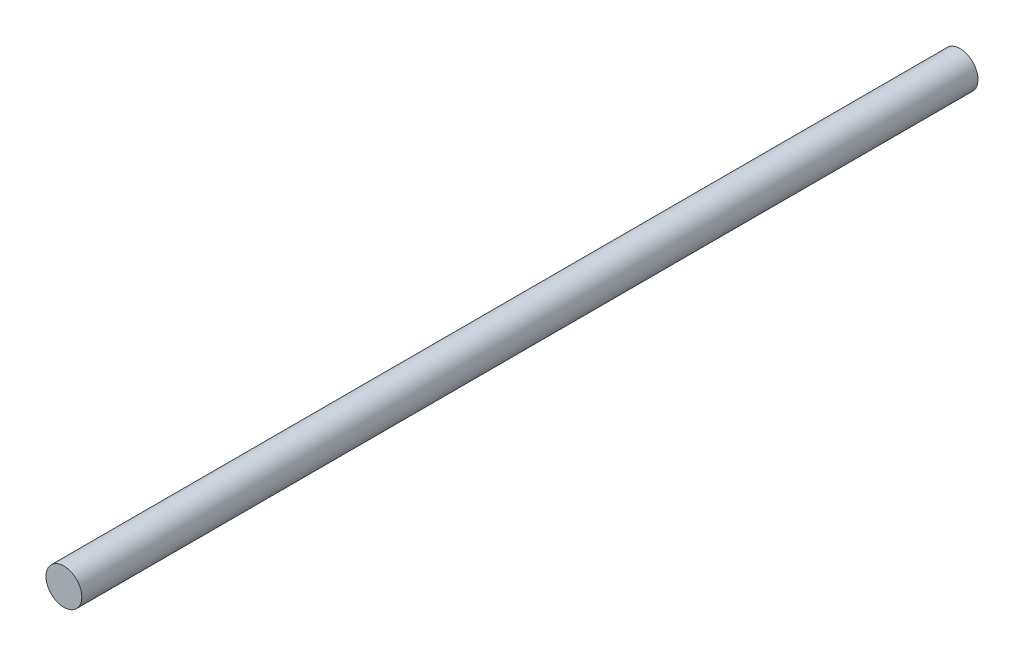
ISO-10303-21;
HEADER;
FILE_DESCRIPTION(('STEP AP214'),'2;1');
FILE_NAME('part.step','',(''),(''),'','','');
FILE_SCHEMA(('AUTOMOTIVE_DESIGN { 1 0 10303 214 1 1 1 1 }'));
ENDSEC;
DATA;
#1=APPLICATION_CONTEXT('core data for automotive mechanical design processes');
#2=APPLICATION_PROTOCOL_DEFINITION('international standard','automotive_design',2000,#1);
#3=PRODUCT_CONTEXT('',#1,'mechanical');
#4=PRODUCT('Part','Part','',(#3));
#5=PRODUCT_RELATED_PRODUCT_CATEGORY('part','',(#4));
#6=PRODUCT_DEFINITION_FORMATION('','',#4);
#7=PRODUCT_DEFINITION_CONTEXT('part definition',#1,'design');
#8=PRODUCT_DEFINITION('design','',#6,#7);
#9=PRODUCT_DEFINITION_SHAPE('','',#8);
#10=(LENGTH_UNIT() NAMED_UNIT(*) SI_UNIT(.MILLI.,.METRE.));
#11=(NAMED_UNIT(*) PLANE_ANGLE_UNIT() SI_UNIT($,.RADIAN.));
#12=(NAMED_UNIT(*) SI_UNIT($,.STERADIAN.) SOLID_ANGLE_UNIT());
#13=UNCERTAINTY_MEASURE_WITH_UNIT(LENGTH_MEASURE(1.E-05),#10,'distance_accuracy_value','');
#14=(GEOMETRIC_REPRESENTATION_CONTEXT(3) GLOBAL_UNCERTAINTY_ASSIGNED_CONTEXT((#13)) GLOBAL_UNIT_ASSIGNED_CONTEXT((#10,
#11,#12)) REPRESENTATION_CONTEXT('',''));
#15=CARTESIAN_POINT('',(0.,0.,0.));
#16=DIRECTION('',(0.,0.,1.));
#17=DIRECTION('',(1.,0.,0.));
#18=AXIS2_PLACEMENT_3D('',#15,#16,#17);
#19=CARTESIAN_POINT('',(0.,0.,150.));
#20=DIRECTION('',(0.,0.,-1.));
#21=DIRECTION('',(-1.,0.,0.));
#22=AXIS2_PLACEMENT_3D('',#19,#20,#21);
#23=CYLINDRICAL_SURFACE('',#22,3.);
#24=CARTESIAN_POINT('',(0.,0.,150.));
#25=DIRECTION('',(0.,0.,1.));
#26=DIRECTION('',(1.,0.,0.));
#27=AXIS2_PLACEMENT_3D('',#24,#25,#26);
#28=CIRCLE('',#27,3.);
#29=CARTESIAN_POINT('',(3.,0.,150.));
#30=VERTEX_POINT('',#29);
#31=EDGE_CURVE('E10',#30,#30,#28,.T.);
#32=ORIENTED_EDGE('',*,*,#31,.F.);
#33=EDGE_LOOP('',(#32));
#34=FACE_BOUND('',#33,.T.);
#35=CARTESIAN_POINT('',(0.,0.,0.));
#36=DIRECTION('',(0.,0.,1.));
#37=DIRECTION('',(1.,0.,0.));
#38=AXIS2_PLACEMENT_3D('',#35,#36,#37);
#39=CIRCLE('',#38,3.);
#40=CARTESIAN_POINT('',(3.,0.,0.));
#41=VERTEX_POINT('',#40);
#42=EDGE_CURVE('E36',#41,#41,#39,.T.);
#43=ORIENTED_EDGE('',*,*,#42,.T.);
#44=EDGE_LOOP('',(#43));
#45=FACE_BOUND('',#44,.T.);
#46=ADVANCED_FACE('F33',(#34,#45),#23,.T.);
#47=CARTESIAN_POINT('',(0.,0.,150.));
#48=DIRECTION('',(0.,0.,1.));
#49=DIRECTION('',(1.,0.,0.));
#50=AXIS2_PLACEMENT_3D('',#47,#48,#49);
#51=PLANE('',#50);
#52=ORIENTED_EDGE('',*,*,#31,.T.);
#53=EDGE_LOOP('',(#52));
#54=FACE_BOUND('',#53,.T.);
#55=ADVANCED_FACE('F48',(#54),#51,.T.);
#56=CARTESIAN_POINT('',(0.,0.,0.));
#57=DIRECTION('',(0.,0.,1.));
#58=DIRECTION('',(1.,0.,0.));
#59=AXIS2_PLACEMENT_3D('',#56,#57,#58);
#60=PLANE('',#59);
#61=ORIENTED_EDGE('',*,*,#42,.F.);
#62=EDGE_LOOP('',(#61));
#63=FACE_BOUND('',#62,.T.);
#64=ADVANCED_FACE('F46',(#63),#60,.F.);
#65=CLOSED_SHELL('',(#46,#55,#64));
#66=MANIFOLD_SOLID_BREP('B2',#65);
#67=ADVANCED_BREP_SHAPE_REPRESENTATION('',(#18,#66),#14);
#68=SHAPE_DEFINITION_REPRESENTATION(#9,#67);
ENDSEC;
END-ISO-10303-21;
